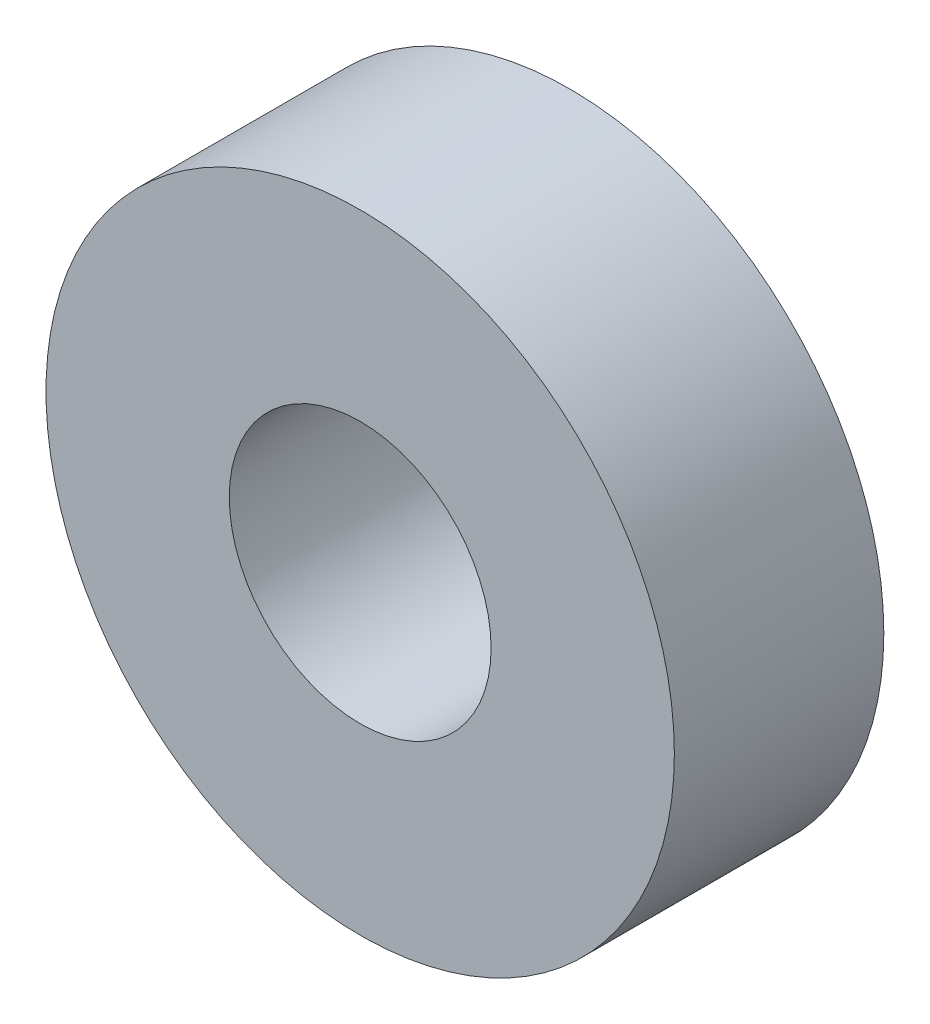
ISO-10303-21;
HEADER;
FILE_DESCRIPTION(('STEP AP214'),'2;1');
FILE_NAME('part.step','',(''),(''),'','','');
FILE_SCHEMA(('AUTOMOTIVE_DESIGN { 1 0 10303 214 1 1 1 1 }'));
ENDSEC;
DATA;
#1=APPLICATION_CONTEXT('core data for automotive mechanical design processes');
#2=APPLICATION_PROTOCOL_DEFINITION('international standard','automotive_design',2000,#1);
#3=PRODUCT_CONTEXT('',#1,'mechanical');
#4=PRODUCT('Part','Part','',(#3));
#5=PRODUCT_RELATED_PRODUCT_CATEGORY('part','',(#4));
#6=PRODUCT_DEFINITION_FORMATION('','',#4);
#7=PRODUCT_DEFINITION_CONTEXT('part definition',#1,'design');
#8=PRODUCT_DEFINITION('design','',#6,#7);
#9=PRODUCT_DEFINITION_SHAPE('','',#8);
#10=(LENGTH_UNIT() NAMED_UNIT(*) SI_UNIT(.MILLI.,.METRE.));
#11=(NAMED_UNIT(*) PLANE_ANGLE_UNIT() SI_UNIT($,.RADIAN.));
#12=(NAMED_UNIT(*) SI_UNIT($,.STERADIAN.) SOLID_ANGLE_UNIT());
#13=UNCERTAINTY_MEASURE_WITH_UNIT(LENGTH_MEASURE(1.E-05),#10,'distance_accuracy_value','');
#14=(GEOMETRIC_REPRESENTATION_CONTEXT(3) GLOBAL_UNCERTAINTY_ASSIGNED_CONTEXT((#13)) GLOBAL_UNIT_ASSIGNED_CONTEXT((#10,
#11,#12)) REPRESENTATION_CONTEXT('',''));
#15=CARTESIAN_POINT('',(0.,0.,0.));
#16=DIRECTION('',(0.,0.,1.));
#17=DIRECTION('',(1.,0.,0.));
#18=AXIS2_PLACEMENT_3D('',#15,#16,#17);
#19=CARTESIAN_POINT('',(0.,0.,4.));
#20=DIRECTION('',(0.,0.,1.));
#21=DIRECTION('',(1.,0.,0.));
#22=AXIS2_PLACEMENT_3D('',#19,#20,#21);
#23=PLANE('',#22);
#24=CARTESIAN_POINT('',(0.,0.,4.));
#25=DIRECTION('',(0.,0.,1.));
#26=DIRECTION('',(1.,0.,0.));
#27=AXIS2_PLACEMENT_3D('',#24,#25,#26);
#28=CIRCLE('',#27,6.);
#29=CARTESIAN_POINT('',(6.,0.,4.));
#30=VERTEX_POINT('',#29);
#31=EDGE_CURVE('E10',#30,#30,#28,.T.);
#32=ORIENTED_EDGE('',*,*,#31,.T.);
#33=EDGE_LOOP('',(#32));
#34=FACE_BOUND('',#33,.T.);
#35=CARTESIAN_POINT('',(0.,0.,4.));
#36=DIRECTION('',(0.,0.,1.));
#37=DIRECTION('',(1.,0.,0.));
#38=AXIS2_PLACEMENT_3D('',#35,#36,#37);
#39=CIRCLE('',#38,2.5);
#40=CARTESIAN_POINT('',(2.5,0.,4.));
#41=VERTEX_POINT('',#40);
#42=EDGE_CURVE('E42',#41,#41,#39,.T.);
#43=ORIENTED_EDGE('',*,*,#42,.F.);
#44=EDGE_LOOP('',(#43));
#45=FACE_BOUND('',#44,.T.);
#46=ADVANCED_FACE('F31',(#34,#45),#23,.T.);
#47=CARTESIAN_POINT('',(0.,0.,0.));
#48=DIRECTION('',(0.,0.,1.));
#49=DIRECTION('',(1.,0.,0.));
#50=AXIS2_PLACEMENT_3D('',#47,#48,#49);
#51=PLANE('',#50);
#52=CARTESIAN_POINT('',(0.,0.,0.));
#53=DIRECTION('',(0.,0.,1.));
#54=DIRECTION('',(1.,0.,0.));
#55=AXIS2_PLACEMENT_3D('',#52,#53,#54);
#56=CIRCLE('',#55,6.);
#57=CARTESIAN_POINT('',(6.,0.,0.));
#58=VERTEX_POINT('',#57);
#59=EDGE_CURVE('E35',#58,#58,#56,.T.);
#60=ORIENTED_EDGE('',*,*,#59,.F.);
#61=EDGE_LOOP('',(#60));
#62=FACE_BOUND('',#61,.T.);
#63=CARTESIAN_POINT('',(0.,0.,0.));
#64=DIRECTION('',(0.,0.,1.));
#65=DIRECTION('',(1.,0.,0.));
#66=AXIS2_PLACEMENT_3D('',#63,#64,#65);
#67=CIRCLE('',#66,2.5);
#68=CARTESIAN_POINT('',(2.5,0.,0.));
#69=VERTEX_POINT('',#68);
#70=EDGE_CURVE('E44',#69,#69,#67,.T.);
#71=ORIENTED_EDGE('',*,*,#70,.T.);
#72=EDGE_LOOP('',(#71));
#73=FACE_BOUND('',#72,.T.);
#74=ADVANCED_FACE('F54',(#62,#73),#51,.F.);
#75=CARTESIAN_POINT('',(0.,0.,4.));
#76=DIRECTION('',(0.,0.,-1.));
#77=DIRECTION('',(-1.,0.,0.));
#78=AXIS2_PLACEMENT_3D('',#75,#76,#77);
#79=CYLINDRICAL_SURFACE('',#78,6.);
#80=ORIENTED_EDGE('',*,*,#31,.F.);
#81=EDGE_LOOP('',(#80));
#82=FACE_BOUND('',#81,.T.);
#83=ORIENTED_EDGE('',*,*,#59,.T.);
#84=EDGE_LOOP('',(#83));
#85=FACE_BOUND('',#84,.T.);
#86=ADVANCED_FACE('F33',(#82,#85),#79,.T.);
#87=CARTESIAN_POINT('',(0.,0.,4.));
#88=DIRECTION('',(0.,0.,-1.));
#89=DIRECTION('',(-1.,0.,0.));
#90=AXIS2_PLACEMENT_3D('',#87,#88,#89);
#91=CYLINDRICAL_SURFACE('',#90,2.5);
#92=ORIENTED_EDGE('',*,*,#42,.T.);
#93=EDGE_LOOP('',(#92));
#94=FACE_BOUND('',#93,.T.);
#95=ORIENTED_EDGE('',*,*,#70,.F.);
#96=EDGE_LOOP('',(#95));
#97=FACE_BOUND('',#96,.T.);
#98=ADVANCED_FACE('F50',(#94,#97),#91,.F.);
#99=CLOSED_SHELL('',(#46,#74,#86,#98));
#100=MANIFOLD_SOLID_BREP('B2',#99);
#101=ADVANCED_BREP_SHAPE_REPRESENTATION('',(#18,#100),#14);
#102=SHAPE_DEFINITION_REPRESENTATION(#9,#101);
ENDSEC;
END-ISO-10303-21;
